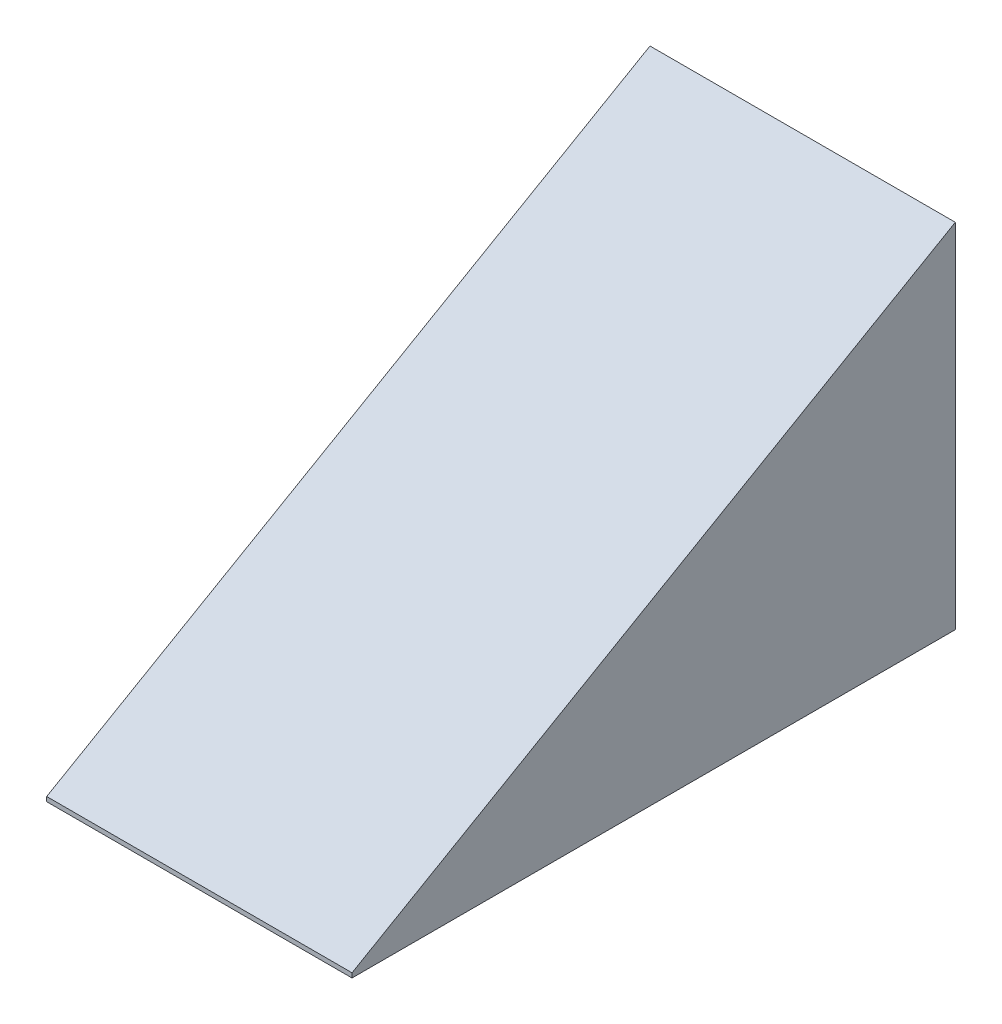
ISO-10303-21;
HEADER;
FILE_DESCRIPTION(('STEP AP214'),'2;1');
FILE_NAME('part.step','',(''),(''),'','','');
FILE_SCHEMA(('AUTOMOTIVE_DESIGN { 1 0 10303 214 1 1 1 1 }'));
ENDSEC;
DATA;
#1=APPLICATION_CONTEXT('core data for automotive mechanical design processes');
#2=APPLICATION_PROTOCOL_DEFINITION('international standard','automotive_design',2000,#1);
#3=PRODUCT_CONTEXT('',#1,'mechanical');
#4=PRODUCT('Part','Part','',(#3));
#5=PRODUCT_RELATED_PRODUCT_CATEGORY('part','',(#4));
#6=PRODUCT_DEFINITION_FORMATION('','',#4);
#7=PRODUCT_DEFINITION_CONTEXT('part definition',#1,'design');
#8=PRODUCT_DEFINITION('design','',#6,#7);
#9=PRODUCT_DEFINITION_SHAPE('','',#8);
#10=(LENGTH_UNIT() NAMED_UNIT(*) SI_UNIT(.MILLI.,.METRE.));
#11=(NAMED_UNIT(*) PLANE_ANGLE_UNIT() SI_UNIT($,.RADIAN.));
#12=(NAMED_UNIT(*) SI_UNIT($,.STERADIAN.) SOLID_ANGLE_UNIT());
#13=UNCERTAINTY_MEASURE_WITH_UNIT(LENGTH_MEASURE(1.E-05),#10,'distance_accuracy_value','');
#14=(GEOMETRIC_REPRESENTATION_CONTEXT(3) GLOBAL_UNCERTAINTY_ASSIGNED_CONTEXT((#13)) GLOBAL_UNIT_ASSIGNED_CONTEXT((#10,
#11,#12)) REPRESENTATION_CONTEXT('',''));
#15=CARTESIAN_POINT('',(0.,0.,0.));
#16=DIRECTION('',(0.,0.,1.));
#17=DIRECTION('',(1.,0.,0.));
#18=AXIS2_PLACEMENT_3D('',#15,#16,#17);
#19=CARTESIAN_POINT('',(42.8625,-48.26,169.377248472163));
#20=DIRECTION('',(0.,-0.866025403784441,-0.499999999999995));
#21=DIRECTION('',(0.,0.499999999999995,-0.866025403784441));
#22=AXIS2_PLACEMENT_3D('',#19,#20,#21);
#23=PLANE('',#22);
#24=DIRECTION('',(0.,-0.499999999999995,0.866025403784441));
#25=VECTOR('',#24,1.);
#26=CARTESIAN_POINT('',(-42.8625,-48.26,169.377248472163));
#27=LINE('',#26,#25);
#28=CARTESIAN_POINT('',(-42.8625,49.53,0.));
#29=VERTEX_POINT('',#28);
#30=CARTESIAN_POINT('',(-42.8625,-48.26,169.377248472163));
#31=VERTEX_POINT('',#30);
#32=EDGE_CURVE('E114',#29,#31,#27,.T.);
#33=ORIENTED_EDGE('',*,*,#32,.T.);
#34=DIRECTION('',(-1.,0.,0.));
#35=VECTOR('',#34,1.);
#36=CARTESIAN_POINT('',(42.8625,-48.26,169.377248472163));
#37=LINE('',#36,#35);
#38=CARTESIAN_POINT('',(42.8625,-48.26,169.377248472163));
#39=VERTEX_POINT('',#38);
#40=EDGE_CURVE('E11',#39,#31,#37,.T.);
#41=ORIENTED_EDGE('',*,*,#40,.F.);
#42=DIRECTION('',(0.,-0.499999999999995,0.866025403784441));
#43=VECTOR('',#42,1.);
#44=CARTESIAN_POINT('',(42.8625,-48.26,169.377248472163));
#45=LINE('',#44,#43);
#46=CARTESIAN_POINT('',(42.8625,49.53,0.));
#47=VERTEX_POINT('',#46);
#48=EDGE_CURVE('E101',#47,#39,#45,.T.);
#49=ORIENTED_EDGE('',*,*,#48,.F.);
#50=DIRECTION('',(-1.,0.,0.));
#51=VECTOR('',#50,1.);
#52=CARTESIAN_POINT('',(42.8625,49.53,0.));
#53=LINE('',#52,#51);
#54=EDGE_CURVE('E110',#47,#29,#53,.T.);
#55=ORIENTED_EDGE('',*,*,#54,.T.);
#56=EDGE_LOOP('',(#33,#41,#49,#55));
#57=FACE_BOUND('',#56,.T.);
#58=ADVANCED_FACE('F49',(#57),#23,.F.);
#59=CARTESIAN_POINT('',(42.8625,-48.26,169.377248472163));
#60=DIRECTION('',(0.,0.,-1.));
#61=DIRECTION('',(0.,1.,0.));
#62=AXIS2_PLACEMENT_3D('',#59,#60,#61);
#63=PLANE('',#62);
#64=DIRECTION('',(0.,-1.,0.));
#65=VECTOR('',#64,1.);
#66=CARTESIAN_POINT('',(-42.8625,-48.26,169.377248472163));
#67=LINE('',#66,#65);
#68=CARTESIAN_POINT('',(-42.8625,-49.53,169.377248472163));
#69=VERTEX_POINT('',#68);
#70=EDGE_CURVE('E105',#31,#69,#67,.T.);
#71=ORIENTED_EDGE('',*,*,#70,.T.);
#72=DIRECTION('',(-1.,0.,0.));
#73=VECTOR('',#72,1.);
#74=CARTESIAN_POINT('',(42.8625,-49.53,169.377248472163));
#75=LINE('',#74,#73);
#76=CARTESIAN_POINT('',(42.8625,-49.53,169.377248472163));
#77=VERTEX_POINT('',#76);
#78=EDGE_CURVE('E57',#77,#69,#75,.T.);
#79=ORIENTED_EDGE('',*,*,#78,.F.);
#80=DIRECTION('',(0.,-1.,0.));
#81=VECTOR('',#80,1.);
#82=CARTESIAN_POINT('',(42.8625,-48.26,169.377248472163));
#83=LINE('',#82,#81);
#84=EDGE_CURVE('E96',#39,#77,#83,.T.);
#85=ORIENTED_EDGE('',*,*,#84,.F.);
#86=ORIENTED_EDGE('',*,*,#40,.T.);
#87=EDGE_LOOP('',(#71,#79,#85,#86));
#88=FACE_BOUND('',#87,.T.);
#89=ADVANCED_FACE('F104',(#88),#63,.F.);
#90=CARTESIAN_POINT('',(42.8625,-49.53,0.));
#91=DIRECTION('',(0.,1.,0.));
#92=DIRECTION('',(0.,0.,1.));
#93=AXIS2_PLACEMENT_3D('',#90,#91,#92);
#94=PLANE('',#93);
#95=DIRECTION('',(0.,0.,-1.));
#96=VECTOR('',#95,1.);
#97=CARTESIAN_POINT('',(-42.8625,-49.53,0.));
#98=LINE('',#97,#96);
#99=CARTESIAN_POINT('',(-42.8625,-49.53,0.));
#100=VERTEX_POINT('',#99);
#101=EDGE_CURVE('E83',#69,#100,#98,.T.);
#102=ORIENTED_EDGE('',*,*,#101,.T.);
#103=DIRECTION('',(-1.,0.,0.));
#104=VECTOR('',#103,1.);
#105=CARTESIAN_POINT('',(42.8625,-49.53,0.));
#106=LINE('',#105,#104);
#107=CARTESIAN_POINT('',(42.8625,-49.53,0.));
#108=VERTEX_POINT('',#107);
#109=EDGE_CURVE('E106',#108,#100,#106,.T.);
#110=ORIENTED_EDGE('',*,*,#109,.F.);
#111=DIRECTION('',(0.,0.,-1.));
#112=VECTOR('',#111,1.);
#113=CARTESIAN_POINT('',(42.8625,-49.53,0.));
#114=LINE('',#113,#112);
#115=EDGE_CURVE('E99',#77,#108,#114,.T.);
#116=ORIENTED_EDGE('',*,*,#115,.F.);
#117=ORIENTED_EDGE('',*,*,#78,.T.);
#118=EDGE_LOOP('',(#102,#110,#116,#117));
#119=FACE_BOUND('',#118,.T.);
#120=ADVANCED_FACE('F107',(#119),#94,.F.);
#121=CARTESIAN_POINT('',(42.8625,49.53,0.));
#122=DIRECTION('',(0.,0.,1.));
#123=DIRECTION('',(1.,0.,0.));
#124=AXIS2_PLACEMENT_3D('',#121,#122,#123);
#125=PLANE('',#124);
#126=CARTESIAN_POINT('',(0.,0.,0.));
#127=DIRECTION('',(0.,0.,-1.));
#128=DIRECTION('',(-1.,0.,0.));
#129=AXIS2_PLACEMENT_3D('',#126,#127,#128);
#130=CIRCLE('',#129,2.8702);
#131=CARTESIAN_POINT('',(-2.8702,0.,0.));
#132=VERTEX_POINT('',#131);
#133=EDGE_CURVE('E132',#132,#132,#130,.T.);
#134=ORIENTED_EDGE('',*,*,#133,.F.);
#135=EDGE_LOOP('',(#134));
#136=FACE_BOUND('',#135,.T.);
#137=DIRECTION('',(0.,1.,0.));
#138=VECTOR('',#137,1.);
#139=CARTESIAN_POINT('',(-42.8625,49.53,0.));
#140=LINE('',#139,#138);
#141=EDGE_CURVE('E89',#100,#29,#140,.T.);
#142=ORIENTED_EDGE('',*,*,#141,.T.);
#143=ORIENTED_EDGE('',*,*,#54,.F.);
#144=DIRECTION('',(0.,1.,0.));
#145=VECTOR('',#144,1.);
#146=CARTESIAN_POINT('',(42.8625,49.53,0.));
#147=LINE('',#146,#145);
#148=EDGE_CURVE('E66',#108,#47,#147,.T.);
#149=ORIENTED_EDGE('',*,*,#148,.F.);
#150=ORIENTED_EDGE('',*,*,#109,.T.);
#151=EDGE_LOOP('',(#142,#143,#149,#150));
#152=FACE_BOUND('',#151,.T.);
#153=ADVANCED_FACE('F123',(#136,#152),#125,.F.);
#154=CARTESIAN_POINT('',(42.8625,0.,0.));
#155=DIRECTION('',(-1.,0.,0.));
#156=DIRECTION('',(0.,0.,1.));
#157=AXIS2_PLACEMENT_3D('',#154,#155,#156);
#158=PLANE('',#157);
#159=ORIENTED_EDGE('',*,*,#48,.T.);
#160=ORIENTED_EDGE('',*,*,#84,.T.);
#161=ORIENTED_EDGE('',*,*,#115,.T.);
#162=ORIENTED_EDGE('',*,*,#148,.T.);
#163=EDGE_LOOP('',(#159,#160,#161,#162));
#164=FACE_BOUND('',#163,.T.);
#165=ADVANCED_FACE('F97',(#164),#158,.F.);
#166=CARTESIAN_POINT('',(-42.8625,0.,0.));
#167=DIRECTION('',(-1.,0.,0.));
#168=DIRECTION('',(0.,0.,1.));
#169=AXIS2_PLACEMENT_3D('',#166,#167,#168);
#170=PLANE('',#169);
#171=ORIENTED_EDGE('',*,*,#32,.F.);
#172=ORIENTED_EDGE('',*,*,#141,.F.);
#173=ORIENTED_EDGE('',*,*,#101,.F.);
#174=ORIENTED_EDGE('',*,*,#70,.F.);
#175=EDGE_LOOP('',(#171,#172,#173,#174));
#176=FACE_BOUND('',#175,.T.);
#177=ADVANCED_FACE('F126',(#176),#170,.T.);
#178=CARTESIAN_POINT('',(0.,0.,0.));
#179=DIRECTION('',(0.,0.,-1.));
#180=DIRECTION('',(-1.,0.,0.));
#181=AXIS2_PLACEMENT_3D('',#178,#179,#180);
#182=CONICAL_SURFACE('',#181,2.8702,0.139626340159547);
#183=CARTESIAN_POINT('',(0.,0.,6.35));
#184=DIRECTION('',(0.,0.,-1.));
#185=DIRECTION('',(-1.,0.,0.));
#186=AXIS2_PLACEMENT_3D('',#183,#184,#185);
#187=CIRCLE('',#186,1.97776569963981);
#188=CARTESIAN_POINT('',(-1.97776569963981,0.,6.35));
#189=VERTEX_POINT('',#188);
#190=EDGE_CURVE('E117',#189,#189,#187,.T.);
#191=ORIENTED_EDGE('',*,*,#190,.F.);
#192=EDGE_LOOP('',(#191));
#193=FACE_BOUND('',#192,.T.);
#194=ORIENTED_EDGE('',*,*,#133,.T.);
#195=EDGE_LOOP('',(#194));
#196=FACE_BOUND('',#195,.T.);
#197=ADVANCED_FACE('F136',(#193,#196),#182,.F.);
#198=CARTESIAN_POINT('',(0.,0.,6.35));
#199=DIRECTION('',(0.,0.,-1.));
#200=DIRECTION('',(-1.,0.,0.));
#201=AXIS2_PLACEMENT_3D('',#198,#199,#200);
#202=PLANE('',#201);
#203=ORIENTED_EDGE('',*,*,#190,.T.);
#204=EDGE_LOOP('',(#203));
#205=FACE_BOUND('',#204,.T.);
#206=ADVANCED_FACE('F189',(#205),#202,.T.);
#207=CLOSED_SHELL('',(#58,#89,#120,#153,#165,#177,#197,#206));
#208=MANIFOLD_SOLID_BREP('B2',#207);
#209=ADVANCED_BREP_SHAPE_REPRESENTATION('',(#18,#208),#14);
#210=SHAPE_DEFINITION_REPRESENTATION(#9,#209);
ENDSEC;
END-ISO-10303-21;
